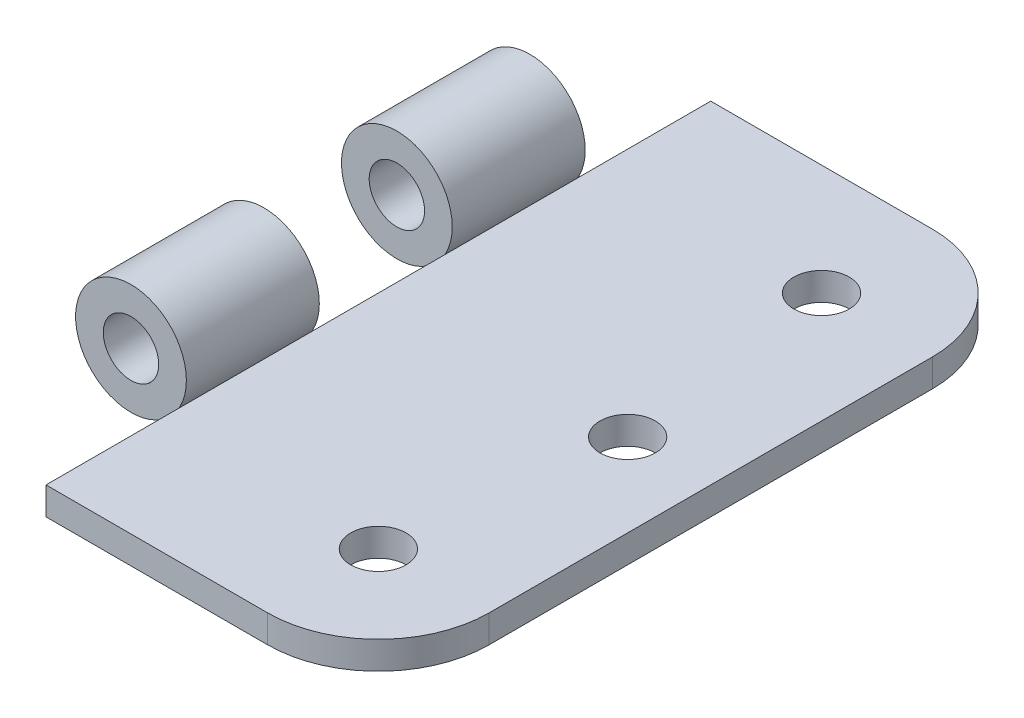
ISO-10303-21;
HEADER;
FILE_DESCRIPTION(('STEP AP214'),'2;1');
FILE_NAME('part.step','',(''),(''),'','','');
FILE_SCHEMA(('AUTOMOTIVE_DESIGN { 1 0 10303 214 1 1 1 1 }'));
ENDSEC;
DATA;
#1=APPLICATION_CONTEXT('core data for automotive mechanical design processes');
#2=APPLICATION_PROTOCOL_DEFINITION('international standard','automotive_design',2000,#1);
#3=PRODUCT_CONTEXT('',#1,'mechanical');
#4=PRODUCT('Part','Part','',(#3));
#5=PRODUCT_RELATED_PRODUCT_CATEGORY('part','',(#4));
#6=PRODUCT_DEFINITION_FORMATION('','',#4);
#7=PRODUCT_DEFINITION_CONTEXT('part definition',#1,'design');
#8=PRODUCT_DEFINITION('design','',#6,#7);
#9=PRODUCT_DEFINITION_SHAPE('','',#8);
#10=(LENGTH_UNIT() NAMED_UNIT(*) SI_UNIT(.MILLI.,.METRE.));
#11=(NAMED_UNIT(*) PLANE_ANGLE_UNIT() SI_UNIT($,.RADIAN.));
#12=(NAMED_UNIT(*) SI_UNIT($,.STERADIAN.) SOLID_ANGLE_UNIT());
#13=UNCERTAINTY_MEASURE_WITH_UNIT(LENGTH_MEASURE(1.E-05),#10,'distance_accuracy_value','');
#14=(GEOMETRIC_REPRESENTATION_CONTEXT(3) GLOBAL_UNCERTAINTY_ASSIGNED_CONTEXT((#13)) GLOBAL_UNIT_ASSIGNED_CONTEXT((#10,
#11,#12)) REPRESENTATION_CONTEXT('',''));
#15=CARTESIAN_POINT('',(0.,0.,0.));
#16=DIRECTION('',(0.,0.,1.));
#17=DIRECTION('',(1.,0.,0.));
#18=AXIS2_PLACEMENT_3D('',#15,#16,#17);
#19=CARTESIAN_POINT('',(0.,3.175,0.));
#20=DIRECTION('',(1.,0.,0.));
#21=DIRECTION('',(0.,0.,-1.));
#22=AXIS2_PLACEMENT_3D('',#19,#20,#21);
#23=PLANE('',#22);
#24=DIRECTION('',(0.,0.,1.));
#25=VECTOR('',#24,1.);
#26=CARTESIAN_POINT('',(0.,0.,0.));
#27=LINE('',#26,#25);
#28=CARTESIAN_POINT('',(0.,0.,-76.2));
#29=VERTEX_POINT('',#28);
#30=CARTESIAN_POINT('',(0.,0.,0.));
#31=VERTEX_POINT('',#30);
#32=EDGE_CURVE('P0_E89',#29,#31,#27,.T.);
#33=ORIENTED_EDGE('',*,*,#32,.T.);
#34=DIRECTION('',(0.,-1.,0.));
#35=VECTOR('',#34,1.);
#36=CARTESIAN_POINT('',(0.,3.175,0.));
#37=LINE('',#36,#35);
#38=CARTESIAN_POINT('',(0.,3.175,0.));
#39=VERTEX_POINT('',#38);
#40=EDGE_CURVE('P0_E74',#39,#31,#37,.T.);
#41=ORIENTED_EDGE('',*,*,#40,.F.);
#42=DIRECTION('',(0.,0.,1.));
#43=VECTOR('',#42,1.);
#44=CARTESIAN_POINT('',(0.,3.175,0.));
#45=LINE('',#44,#43);
#46=CARTESIAN_POINT('',(0.,3.175,-76.2));
#47=VERTEX_POINT('',#46);
#48=EDGE_CURVE('P0_E78',#47,#39,#45,.T.);
#49=ORIENTED_EDGE('',*,*,#48,.F.);
#50=DIRECTION('',(0.,-1.,0.));
#51=VECTOR('',#50,1.);
#52=CARTESIAN_POINT('',(0.,3.175,-76.2));
#53=LINE('',#52,#51);
#54=EDGE_CURVE('P0_E91',#47,#29,#53,.T.);
#55=ORIENTED_EDGE('',*,*,#54,.T.);
#56=EDGE_LOOP('',(#33,#41,#49,#55));
#57=FACE_BOUND('',#56,.T.);
#58=ADVANCED_FACE('P0_F17',(#57),#23,.F.);
#59=CARTESIAN_POINT('',(0.,3.175,0.));
#60=DIRECTION('',(0.,0.,-1.));
#61=DIRECTION('',(-1.,0.,0.));
#62=AXIS2_PLACEMENT_3D('',#59,#60,#61);
#63=PLANE('',#62);
#64=DIRECTION('',(1.,0.,0.));
#65=VECTOR('',#64,1.);
#66=CARTESIAN_POINT('',(0.,0.,0.));
#67=LINE('',#66,#65);
#68=CARTESIAN_POINT('',(25.4,0.,0.));
#69=VERTEX_POINT('',#68);
#70=EDGE_CURVE('P0_E117',#31,#69,#67,.T.);
#71=ORIENTED_EDGE('',*,*,#70,.T.);
#72=DIRECTION('',(0.,-1.,0.));
#73=VECTOR('',#72,1.);
#74=CARTESIAN_POINT('',(25.4,3.175,0.));
#75=LINE('',#74,#73);
#76=CARTESIAN_POINT('',(25.4,3.175,0.));
#77=VERTEX_POINT('',#76);
#78=EDGE_CURVE('P0_E40',#69,#77,#75,.F.);
#79=ORIENTED_EDGE('',*,*,#78,.T.);
#80=DIRECTION('',(1.,0.,0.));
#81=VECTOR('',#80,1.);
#82=CARTESIAN_POINT('',(0.,3.175,0.));
#83=LINE('',#82,#81);
#84=EDGE_CURVE('P0_E70',#39,#77,#83,.T.);
#85=ORIENTED_EDGE('',*,*,#84,.F.);
#86=ORIENTED_EDGE('',*,*,#40,.T.);
#87=EDGE_LOOP('',(#71,#79,#85,#86));
#88=FACE_BOUND('',#87,.T.);
#89=ADVANCED_FACE('P0_F72',(#88),#63,.F.);
#90=CARTESIAN_POINT('',(38.1,3.175,0.));
#91=DIRECTION('',(-1.,0.,0.));
#92=DIRECTION('',(0.,0.,1.));
#93=AXIS2_PLACEMENT_3D('',#90,#91,#92);
#94=PLANE('',#93);
#95=DIRECTION('',(0.,0.,-1.));
#96=VECTOR('',#95,1.);
#97=CARTESIAN_POINT('',(38.1,3.175,0.));
#98=LINE('',#97,#96);
#99=CARTESIAN_POINT('',(38.1,3.175,-12.7));
#100=VERTEX_POINT('',#99);
#101=CARTESIAN_POINT('',(38.1,3.175,-63.5));
#102=VERTEX_POINT('',#101);
#103=EDGE_CURVE('P0_E77',#100,#102,#98,.T.);
#104=ORIENTED_EDGE('',*,*,#103,.F.);
#105=DIRECTION('',(0.,-1.,0.));
#106=VECTOR('',#105,1.);
#107=CARTESIAN_POINT('',(38.1,3.175,-12.7));
#108=LINE('',#107,#106);
#109=CARTESIAN_POINT('',(38.1,0.,-12.7));
#110=VERTEX_POINT('',#109);
#111=EDGE_CURVE('P0_E93',#100,#110,#108,.T.);
#112=ORIENTED_EDGE('',*,*,#111,.T.);
#113=DIRECTION('',(0.,0.,-1.));
#114=VECTOR('',#113,1.);
#115=CARTESIAN_POINT('',(38.1,0.,0.));
#116=LINE('',#115,#114);
#117=CARTESIAN_POINT('',(38.1,0.,-63.5));
#118=VERTEX_POINT('',#117);
#119=EDGE_CURVE('P0_E118',#110,#118,#116,.T.);
#120=ORIENTED_EDGE('',*,*,#119,.T.);
#121=DIRECTION('',(0.,-1.,0.));
#122=VECTOR('',#121,1.);
#123=CARTESIAN_POINT('',(38.1,3.175,-63.5));
#124=LINE('',#123,#122);
#125=EDGE_CURVE('P0_E90',#118,#102,#124,.F.);
#126=ORIENTED_EDGE('',*,*,#125,.T.);
#127=EDGE_LOOP('',(#104,#112,#120,#126));
#128=FACE_BOUND('',#127,.T.);
#129=ADVANCED_FACE('P0_F109',(#128),#94,.F.);
#130=CARTESIAN_POINT('',(0.,3.175,-76.2));
#131=DIRECTION('',(0.,0.,1.));
#132=DIRECTION('',(1.,0.,0.));
#133=AXIS2_PLACEMENT_3D('',#130,#131,#132);
#134=PLANE('',#133);
#135=DIRECTION('',(-1.,0.,0.));
#136=VECTOR('',#135,1.);
#137=CARTESIAN_POINT('',(0.,3.175,-76.2));
#138=LINE('',#137,#136);
#139=CARTESIAN_POINT('',(25.4,3.175,-76.2));
#140=VERTEX_POINT('',#139);
#141=EDGE_CURVE('P0_E82',#140,#47,#138,.T.);
#142=ORIENTED_EDGE('',*,*,#141,.F.);
#143=DIRECTION('',(0.,-1.,0.));
#144=VECTOR('',#143,1.);
#145=CARTESIAN_POINT('',(25.4,3.175,-76.2));
#146=LINE('',#145,#144);
#147=CARTESIAN_POINT('',(25.4,0.,-76.2));
#148=VERTEX_POINT('',#147);
#149=EDGE_CURVE('P0_E11',#140,#148,#146,.T.);
#150=ORIENTED_EDGE('',*,*,#149,.T.);
#151=DIRECTION('',(-1.,0.,0.));
#152=VECTOR('',#151,1.);
#153=CARTESIAN_POINT('',(0.,0.,-76.2));
#154=LINE('',#153,#152);
#155=EDGE_CURVE('P0_E86',#148,#29,#154,.T.);
#156=ORIENTED_EDGE('',*,*,#155,.T.);
#157=ORIENTED_EDGE('',*,*,#54,.F.);
#158=EDGE_LOOP('',(#142,#150,#156,#157));
#159=FACE_BOUND('',#158,.T.);
#160=ADVANCED_FACE('P0_F126',(#159),#134,.F.);
#161=CARTESIAN_POINT('',(0.,3.175,-76.2));
#162=DIRECTION('',(0.,-1.,0.));
#163=DIRECTION('',(0.,0.,-1.));
#164=AXIS2_PLACEMENT_3D('',#161,#162,#163);
#165=PLANE('',#164);
#166=CARTESIAN_POINT('',(25.4,3.175,-12.7));
#167=DIRECTION('',(0.,1.,0.));
#168=DIRECTION('',(0.,0.,-1.));
#169=AXIS2_PLACEMENT_3D('',#166,#167,#168);
#170=CIRCLE('',#169,3.175);
#171=CARTESIAN_POINT('',(25.4,3.175,-15.875));
#172=VERTEX_POINT('',#171);
#173=EDGE_CURVE('P0_E173',#172,#172,#170,.T.);
#174=ORIENTED_EDGE('',*,*,#173,.F.);
#175=EDGE_LOOP('',(#174));
#176=FACE_BOUND('',#175,.T.);
#177=CARTESIAN_POINT('',(28.575,3.175,-38.1));
#178=DIRECTION('',(0.,1.,0.));
#179=DIRECTION('',(0.,0.,1.));
#180=AXIS2_PLACEMENT_3D('',#177,#178,#179);
#181=CIRCLE('',#180,3.175);
#182=CARTESIAN_POINT('',(28.575,3.175,-34.925));
#183=VERTEX_POINT('',#182);
#184=EDGE_CURVE('P0_E177',#183,#183,#181,.T.);
#185=ORIENTED_EDGE('',*,*,#184,.F.);
#186=EDGE_LOOP('',(#185));
#187=FACE_BOUND('',#186,.T.);
#188=CARTESIAN_POINT('',(25.4,3.175,-63.5));
#189=DIRECTION('',(0.,1.,0.));
#190=DIRECTION('',(0.,0.,1.));
#191=AXIS2_PLACEMENT_3D('',#188,#189,#190);
#192=CIRCLE('',#191,3.175);
#193=CARTESIAN_POINT('',(25.4,3.175,-60.325));
#194=VERTEX_POINT('',#193);
#195=EDGE_CURVE('P0_E121',#194,#194,#192,.T.);
#196=ORIENTED_EDGE('',*,*,#195,.F.);
#197=EDGE_LOOP('',(#196));
#198=FACE_BOUND('',#197,.T.);
#199=ORIENTED_EDGE('',*,*,#84,.T.);
#200=CARTESIAN_POINT('',(25.4,3.175,-12.7));
#201=DIRECTION('',(0.,-1.,0.));
#202=DIRECTION('',(0.,0.,-1.));
#203=AXIS2_PLACEMENT_3D('',#200,#201,#202);
#204=CIRCLE('',#203,12.7);
#205=EDGE_CURVE('P0_E25',#77,#100,#204,.F.);
#206=ORIENTED_EDGE('',*,*,#205,.T.);
#207=ORIENTED_EDGE('',*,*,#103,.T.);
#208=CARTESIAN_POINT('',(25.4,3.175,-63.5));
#209=DIRECTION('',(0.,-1.,0.));
#210=DIRECTION('',(0.,0.,-1.));
#211=AXIS2_PLACEMENT_3D('',#208,#209,#210);
#212=CIRCLE('',#211,12.7);
#213=EDGE_CURVE('P0_E32',#102,#140,#212,.F.);
#214=ORIENTED_EDGE('',*,*,#213,.T.);
#215=ORIENTED_EDGE('',*,*,#141,.T.);
#216=ORIENTED_EDGE('',*,*,#48,.T.);
#217=EDGE_LOOP('',(#199,#206,#207,#214,#215,#216));
#218=FACE_BOUND('',#217,.T.);
#219=ADVANCED_FACE('P0_F81',(#176,#187,#198,#218),#165,.F.);
#220=CARTESIAN_POINT('',(0.,0.,-76.2));
#221=DIRECTION('',(0.,-1.,0.));
#222=DIRECTION('',(0.,0.,-1.));
#223=AXIS2_PLACEMENT_3D('',#220,#221,#222);
#224=PLANE('',#223);
#225=CARTESIAN_POINT('',(25.4,0.,-12.7));
#226=DIRECTION('',(0.,-1.,0.));
#227=DIRECTION('',(0.,0.,-1.));
#228=AXIS2_PLACEMENT_3D('',#225,#226,#227);
#229=CIRCLE('',#228,3.175);
#230=CARTESIAN_POINT('',(25.4,0.,-15.875));
#231=VERTEX_POINT('',#230);
#232=EDGE_CURVE('P0_E170',#231,#231,#229,.F.);
#233=ORIENTED_EDGE('',*,*,#232,.T.);
#234=EDGE_LOOP('',(#233));
#235=FACE_BOUND('',#234,.T.);
#236=CARTESIAN_POINT('',(28.575,0.,-38.1));
#237=DIRECTION('',(0.,-1.,0.));
#238=DIRECTION('',(0.,0.,-1.));
#239=AXIS2_PLACEMENT_3D('',#236,#237,#238);
#240=CIRCLE('',#239,3.175);
#241=CARTESIAN_POINT('',(28.575,0.,-41.275));
#242=VERTEX_POINT('',#241);
#243=EDGE_CURVE('P0_E174',#242,#242,#240,.F.);
#244=ORIENTED_EDGE('',*,*,#243,.T.);
#245=EDGE_LOOP('',(#244));
#246=FACE_BOUND('',#245,.T.);
#247=CARTESIAN_POINT('',(25.4,0.,-63.5));
#248=DIRECTION('',(0.,-1.,0.));
#249=DIRECTION('',(0.,0.,-1.));
#250=AXIS2_PLACEMENT_3D('',#247,#248,#249);
#251=CIRCLE('',#250,3.175);
#252=CARTESIAN_POINT('',(25.4,0.,-66.675));
#253=VERTEX_POINT('',#252);
#254=EDGE_CURVE('P0_E182',#253,#253,#251,.F.);
#255=ORIENTED_EDGE('',*,*,#254,.T.);
#256=EDGE_LOOP('',(#255));
#257=FACE_BOUND('',#256,.T.);
#258=ORIENTED_EDGE('',*,*,#119,.F.);
#259=CARTESIAN_POINT('',(25.4,0.,-12.7));
#260=DIRECTION('',(0.,-1.,0.));
#261=DIRECTION('',(0.,0.,-1.));
#262=AXIS2_PLACEMENT_3D('',#259,#260,#261);
#263=CIRCLE('',#262,12.7);
#264=EDGE_CURVE('P0_E102',#110,#69,#263,.T.);
#265=ORIENTED_EDGE('',*,*,#264,.T.);
#266=ORIENTED_EDGE('',*,*,#70,.F.);
#267=ORIENTED_EDGE('',*,*,#32,.F.);
#268=ORIENTED_EDGE('',*,*,#155,.F.);
#269=CARTESIAN_POINT('',(25.4,0.,-63.5));
#270=DIRECTION('',(0.,-1.,0.));
#271=DIRECTION('',(0.,0.,-1.));
#272=AXIS2_PLACEMENT_3D('',#269,#270,#271);
#273=CIRCLE('',#272,12.7);
#274=EDGE_CURVE('P0_E100',#148,#118,#273,.T.);
#275=ORIENTED_EDGE('',*,*,#274,.T.);
#276=EDGE_LOOP('',(#258,#265,#266,#267,#268,#275));
#277=FACE_BOUND('',#276,.T.);
#278=ADVANCED_FACE('P0_F116',(#235,#246,#257,#277),#224,.T.);
#279=CARTESIAN_POINT('',(25.4,-0.00100000000000013,-63.5));
#280=DIRECTION('',(0.,1.,0.));
#281=DIRECTION('',(0.,0.,1.));
#282=AXIS2_PLACEMENT_3D('',#279,#280,#281);
#283=CYLINDRICAL_SURFACE('',#282,3.175);
#284=ORIENTED_EDGE('',*,*,#254,.F.);
#285=EDGE_LOOP('',(#284));
#286=FACE_BOUND('',#285,.T.);
#287=ORIENTED_EDGE('',*,*,#195,.T.);
#288=EDGE_LOOP('',(#287));
#289=FACE_BOUND('',#288,.T.);
#290=ADVANCED_FACE('P0_F150',(#286,#289),#283,.F.);
#291=CARTESIAN_POINT('',(28.575,-0.00100000000000013,-38.1));
#292=DIRECTION('',(0.,1.,0.));
#293=DIRECTION('',(0.,0.,1.));
#294=AXIS2_PLACEMENT_3D('',#291,#292,#293);
#295=CYLINDRICAL_SURFACE('',#294,3.175);
#296=ORIENTED_EDGE('',*,*,#243,.F.);
#297=EDGE_LOOP('',(#296));
#298=FACE_BOUND('',#297,.T.);
#299=ORIENTED_EDGE('',*,*,#184,.T.);
#300=EDGE_LOOP('',(#299));
#301=FACE_BOUND('',#300,.T.);
#302=ADVANCED_FACE('P0_F157',(#298,#301),#295,.F.);
#303=CARTESIAN_POINT('',(25.4,-0.00100000000000013,-12.7));
#304=DIRECTION('',(0.,1.,0.));
#305=DIRECTION('',(0.,0.,1.));
#306=AXIS2_PLACEMENT_3D('',#303,#304,#305);
#307=CYLINDRICAL_SURFACE('',#306,3.175);
#308=ORIENTED_EDGE('',*,*,#232,.F.);
#309=EDGE_LOOP('',(#308));
#310=FACE_BOUND('',#309,.T.);
#311=ORIENTED_EDGE('',*,*,#173,.T.);
#312=EDGE_LOOP('',(#311));
#313=FACE_BOUND('',#312,.T.);
#314=ADVANCED_FACE('P0_F135',(#310,#313),#307,.F.);
#315=CARTESIAN_POINT('',(25.4,3.175,-12.7));
#316=DIRECTION('',(0.,-1.,0.));
#317=DIRECTION('',(0.,0.,-1.));
#318=AXIS2_PLACEMENT_3D('',#315,#316,#317);
#319=CYLINDRICAL_SURFACE('',#318,12.7);
#320=ORIENTED_EDGE('',*,*,#205,.F.);
#321=ORIENTED_EDGE('',*,*,#78,.F.);
#322=ORIENTED_EDGE('',*,*,#264,.F.);
#323=ORIENTED_EDGE('',*,*,#111,.F.);
#324=EDGE_LOOP('',(#320,#321,#322,#323));
#325=FACE_BOUND('',#324,.T.);
#326=ADVANCED_FACE('P0_F114',(#325),#319,.T.);
#327=CARTESIAN_POINT('',(25.4,3.175,-63.5));
#328=DIRECTION('',(0.,-1.,0.));
#329=DIRECTION('',(0.,0.,-1.));
#330=AXIS2_PLACEMENT_3D('',#327,#328,#329);
#331=CYLINDRICAL_SURFACE('',#330,12.7);
#332=ORIENTED_EDGE('',*,*,#213,.F.);
#333=ORIENTED_EDGE('',*,*,#125,.F.);
#334=ORIENTED_EDGE('',*,*,#274,.F.);
#335=ORIENTED_EDGE('',*,*,#149,.F.);
#336=EDGE_LOOP('',(#332,#333,#334,#335));
#337=FACE_BOUND('',#336,.T.);
#338=ADVANCED_FACE('P0_F19',(#337),#331,.T.);
#339=CLOSED_SHELL('',(#58,#89,#129,#160,#219,#278,#290,#302,#314,#326,#338));
#340=MANIFOLD_SOLID_BREP('P0_B1',#339);
#341=CARTESIAN_POINT('',(-5.49926131403119,6.35,-30.48));
#342=DIRECTION('',(0.,0.,1.));
#343=DIRECTION('',(1.,0.,0.));
#344=AXIS2_PLACEMENT_3D('',#341,#342,#343);
#345=CYLINDRICAL_SURFACE('',#344,6.35);
#346=CARTESIAN_POINT('',(-5.49926131403119,6.35,-30.48));
#347=DIRECTION('',(0.,0.,1.));
#348=DIRECTION('',(1.,0.,0.));
#349=AXIS2_PLACEMENT_3D('',#346,#347,#348);
#350=CIRCLE('',#349,6.35);
#351=CARTESIAN_POINT('',(0.85073868596881,6.35,-30.48));
#352=VERTEX_POINT('',#351);
#353=EDGE_CURVE('P1_E10',#352,#352,#350,.T.);
#354=ORIENTED_EDGE('',*,*,#353,.T.);
#355=EDGE_LOOP('',(#354));
#356=FACE_BOUND('',#355,.T.);
#357=CARTESIAN_POINT('',(-5.49926131403119,6.35,-15.24));
#358=DIRECTION('',(0.,0.,1.));
#359=DIRECTION('',(1.,0.,0.));
#360=AXIS2_PLACEMENT_3D('',#357,#358,#359);
#361=CIRCLE('',#360,6.35);
#362=CARTESIAN_POINT('',(0.85073868596881,6.35,-15.24));
#363=VERTEX_POINT('',#362);
#364=EDGE_CURVE('P1_E18',#363,#363,#361,.T.);
#365=ORIENTED_EDGE('',*,*,#364,.F.);
#366=EDGE_LOOP('',(#365));
#367=FACE_BOUND('',#366,.T.);
#368=ADVANCED_FACE('P1_F15',(#356,#367),#345,.T.);
#369=CARTESIAN_POINT('',(-5.49926131403119,6.35,-30.48));
#370=DIRECTION('',(0.,0.,1.));
#371=DIRECTION('',(1.,0.,0.));
#372=AXIS2_PLACEMENT_3D('',#369,#370,#371);
#373=PLANE('',#372);
#374=CARTESIAN_POINT('',(-5.49926131403119,6.35,-30.48));
#375=DIRECTION('',(0.,0.,1.));
#376=DIRECTION('',(1.,0.,0.));
#377=AXIS2_PLACEMENT_3D('',#374,#375,#376);
#378=CIRCLE('',#377,3.175);
#379=CARTESIAN_POINT('',(-2.32426131403119,6.35,-30.48));
#380=VERTEX_POINT('',#379);
#381=EDGE_CURVE('P1_E25',#380,#380,#378,.T.);
#382=ORIENTED_EDGE('',*,*,#381,.T.);
#383=EDGE_LOOP('',(#382));
#384=FACE_BOUND('',#383,.T.);
#385=ORIENTED_EDGE('',*,*,#353,.F.);
#386=EDGE_LOOP('',(#385));
#387=FACE_BOUND('',#386,.T.);
#388=ADVANCED_FACE('P1_F33',(#384,#387),#373,.F.);
#389=CARTESIAN_POINT('',(-5.49926131403119,6.35,-15.24));
#390=DIRECTION('',(0.,0.,1.));
#391=DIRECTION('',(1.,0.,0.));
#392=AXIS2_PLACEMENT_3D('',#389,#390,#391);
#393=PLANE('',#392);
#394=CARTESIAN_POINT('',(-5.49926131403119,6.35,-15.24));
#395=DIRECTION('',(0.,0.,1.));
#396=DIRECTION('',(1.,0.,0.));
#397=AXIS2_PLACEMENT_3D('',#394,#395,#396);
#398=CIRCLE('',#397,3.175);
#399=CARTESIAN_POINT('',(-2.32426131403119,6.35,-15.24));
#400=VERTEX_POINT('',#399);
#401=EDGE_CURVE('P1_E27',#400,#400,#398,.T.);
#402=ORIENTED_EDGE('',*,*,#401,.F.);
#403=EDGE_LOOP('',(#402));
#404=FACE_BOUND('',#403,.T.);
#405=ORIENTED_EDGE('',*,*,#364,.T.);
#406=EDGE_LOOP('',(#405));
#407=FACE_BOUND('',#406,.T.);
#408=ADVANCED_FACE('P1_F39',(#404,#407),#393,.T.);
#409=CARTESIAN_POINT('',(-5.49926131403119,6.35,-30.48));
#410=DIRECTION('',(0.,0.,1.));
#411=DIRECTION('',(1.,0.,0.));
#412=AXIS2_PLACEMENT_3D('',#409,#410,#411);
#413=CYLINDRICAL_SURFACE('',#412,3.175);
#414=ORIENTED_EDGE('',*,*,#381,.F.);
#415=EDGE_LOOP('',(#414));
#416=FACE_BOUND('',#415,.T.);
#417=ORIENTED_EDGE('',*,*,#401,.T.);
#418=EDGE_LOOP('',(#417));
#419=FACE_BOUND('',#418,.T.);
#420=ADVANCED_FACE('P1_F36',(#416,#419),#413,.F.);
#421=CLOSED_SHELL('',(#368,#388,#408,#420));
#422=MANIFOLD_SOLID_BREP('P1_B1',#421);
#423=CARTESIAN_POINT('',(-5.49926131403119,6.35,-60.96));
#424=DIRECTION('',(0.,0.,1.));
#425=DIRECTION('',(1.,0.,0.));
#426=AXIS2_PLACEMENT_3D('',#423,#424,#425);
#427=CYLINDRICAL_SURFACE('',#426,6.35);
#428=CARTESIAN_POINT('',(-5.49926131403119,6.35,-60.96));
#429=DIRECTION('',(0.,0.,1.));
#430=DIRECTION('',(1.,0.,0.));
#431=AXIS2_PLACEMENT_3D('',#428,#429,#430);
#432=CIRCLE('',#431,6.35);
#433=CARTESIAN_POINT('',(0.85073868596881,6.35,-60.96));
#434=VERTEX_POINT('',#433);
#435=EDGE_CURVE('P2_E10',#434,#434,#432,.T.);
#436=ORIENTED_EDGE('',*,*,#435,.T.);
#437=EDGE_LOOP('',(#436));
#438=FACE_BOUND('',#437,.T.);
#439=CARTESIAN_POINT('',(-5.49926131403119,6.35,-45.72));
#440=DIRECTION('',(0.,0.,1.));
#441=DIRECTION('',(1.,0.,0.));
#442=AXIS2_PLACEMENT_3D('',#439,#440,#441);
#443=CIRCLE('',#442,6.35);
#444=CARTESIAN_POINT('',(0.85073868596881,6.35,-45.72));
#445=VERTEX_POINT('',#444);
#446=EDGE_CURVE('P2_E18',#445,#445,#443,.T.);
#447=ORIENTED_EDGE('',*,*,#446,.F.);
#448=EDGE_LOOP('',(#447));
#449=FACE_BOUND('',#448,.T.);
#450=ADVANCED_FACE('P2_F15',(#438,#449),#427,.T.);
#451=CARTESIAN_POINT('',(-5.49926131403119,6.35,-60.96));
#452=DIRECTION('',(0.,0.,1.));
#453=DIRECTION('',(1.,0.,0.));
#454=AXIS2_PLACEMENT_3D('',#451,#452,#453);
#455=PLANE('',#454);
#456=CARTESIAN_POINT('',(-5.49926131403119,6.35,-60.96));
#457=DIRECTION('',(0.,0.,1.));
#458=DIRECTION('',(1.,0.,0.));
#459=AXIS2_PLACEMENT_3D('',#456,#457,#458);
#460=CIRCLE('',#459,3.175);
#461=CARTESIAN_POINT('',(-2.32426131403119,6.35,-60.96));
#462=VERTEX_POINT('',#461);
#463=EDGE_CURVE('P2_E25',#462,#462,#460,.T.);
#464=ORIENTED_EDGE('',*,*,#463,.T.);
#465=EDGE_LOOP('',(#464));
#466=FACE_BOUND('',#465,.T.);
#467=ORIENTED_EDGE('',*,*,#435,.F.);
#468=EDGE_LOOP('',(#467));
#469=FACE_BOUND('',#468,.T.);
#470=ADVANCED_FACE('P2_F33',(#466,#469),#455,.F.);
#471=CARTESIAN_POINT('',(-5.49926131403119,6.35,-45.72));
#472=DIRECTION('',(0.,0.,1.));
#473=DIRECTION('',(1.,0.,0.));
#474=AXIS2_PLACEMENT_3D('',#471,#472,#473);
#475=PLANE('',#474);
#476=CARTESIAN_POINT('',(-5.49926131403119,6.35,-45.72));
#477=DIRECTION('',(0.,0.,1.));
#478=DIRECTION('',(1.,0.,0.));
#479=AXIS2_PLACEMENT_3D('',#476,#477,#478);
#480=CIRCLE('',#479,3.175);
#481=CARTESIAN_POINT('',(-2.32426131403119,6.35,-45.72));
#482=VERTEX_POINT('',#481);
#483=EDGE_CURVE('P2_E27',#482,#482,#480,.T.);
#484=ORIENTED_EDGE('',*,*,#483,.F.);
#485=EDGE_LOOP('',(#484));
#486=FACE_BOUND('',#485,.T.);
#487=ORIENTED_EDGE('',*,*,#446,.T.);
#488=EDGE_LOOP('',(#487));
#489=FACE_BOUND('',#488,.T.);
#490=ADVANCED_FACE('P2_F39',(#486,#489),#475,.T.);
#491=CARTESIAN_POINT('',(-5.49926131403119,6.35,-60.96));
#492=DIRECTION('',(0.,0.,1.));
#493=DIRECTION('',(1.,0.,0.));
#494=AXIS2_PLACEMENT_3D('',#491,#492,#493);
#495=CYLINDRICAL_SURFACE('',#494,3.175);
#496=ORIENTED_EDGE('',*,*,#463,.F.);
#497=EDGE_LOOP('',(#496));
#498=FACE_BOUND('',#497,.T.);
#499=ORIENTED_EDGE('',*,*,#483,.T.);
#500=EDGE_LOOP('',(#499));
#501=FACE_BOUND('',#500,.T.);
#502=ADVANCED_FACE('P2_F36',(#498,#501),#495,.F.);
#503=CLOSED_SHELL('',(#450,#470,#490,#502));
#504=MANIFOLD_SOLID_BREP('P2_B1',#503);
#505=ADVANCED_BREP_SHAPE_REPRESENTATION('',(#18,#340,#422,#504),#14);
#506=SHAPE_DEFINITION_REPRESENTATION(#9,#505);
ENDSEC;
END-ISO-10303-21;
